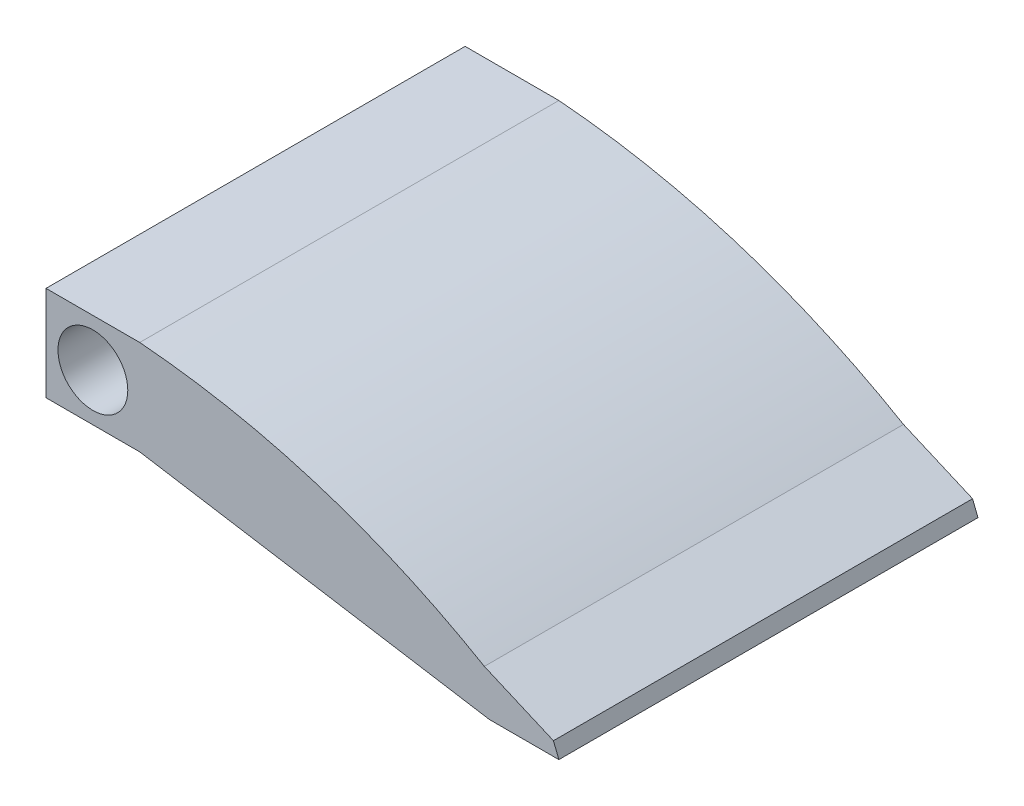
ISO-10303-21;
HEADER;
FILE_DESCRIPTION(('STEP AP214'),'2;1');
FILE_NAME('part.step','',(''),(''),'','','');
FILE_SCHEMA(('AUTOMOTIVE_DESIGN { 1 0 10303 214 1 1 1 1 }'));
ENDSEC;
DATA;
#1=APPLICATION_CONTEXT('core data for automotive mechanical design processes');
#2=APPLICATION_PROTOCOL_DEFINITION('international standard','automotive_design',2000,#1);
#3=PRODUCT_CONTEXT('',#1,'mechanical');
#4=PRODUCT('Part','Part','',(#3));
#5=PRODUCT_RELATED_PRODUCT_CATEGORY('part','',(#4));
#6=PRODUCT_DEFINITION_FORMATION('','',#4);
#7=PRODUCT_DEFINITION_CONTEXT('part definition',#1,'design');
#8=PRODUCT_DEFINITION('design','',#6,#7);
#9=PRODUCT_DEFINITION_SHAPE('','',#8);
#10=(LENGTH_UNIT() NAMED_UNIT(*) SI_UNIT(.MILLI.,.METRE.));
#11=(NAMED_UNIT(*) PLANE_ANGLE_UNIT() SI_UNIT($,.RADIAN.));
#12=(NAMED_UNIT(*) SI_UNIT($,.STERADIAN.) SOLID_ANGLE_UNIT());
#13=UNCERTAINTY_MEASURE_WITH_UNIT(LENGTH_MEASURE(1.E-05),#10,'distance_accuracy_value','');
#14=(GEOMETRIC_REPRESENTATION_CONTEXT(3) GLOBAL_UNCERTAINTY_ASSIGNED_CONTEXT((#13)) GLOBAL_UNIT_ASSIGNED_CONTEXT((#10,
#11,#12)) REPRESENTATION_CONTEXT('',''));
#15=CARTESIAN_POINT('',(0.,0.,0.));
#16=DIRECTION('',(0.,0.,1.));
#17=DIRECTION('',(1.,0.,0.));
#18=AXIS2_PLACEMENT_3D('',#15,#16,#17);
#19=CARTESIAN_POINT('',(-3.36977710472858,0.,30.13));
#20=DIRECTION('',(-1.,0.,0.));
#21=DIRECTION('',(0.,0.,1.));
#22=AXIS2_PLACEMENT_3D('',#19,#20,#21);
#23=PLANE('',#22);
#24=DIRECTION('',(0.,1.,0.));
#25=VECTOR('',#24,1.);
#26=CARTESIAN_POINT('',(-3.36977710472858,0.,0.));
#27=LINE('',#26,#25);
#28=CARTESIAN_POINT('',(-3.36977710472858,-3.40633888704991,0.));
#29=VERTEX_POINT('',#28);
#30=CARTESIAN_POINT('',(-3.36977710472858,3.40633888704991,0.));
#31=VERTEX_POINT('',#30);
#32=EDGE_CURVE('E150',#29,#31,#27,.T.);
#33=ORIENTED_EDGE('',*,*,#32,.F.);
#34=DIRECTION('',(0.,0.,-1.));
#35=VECTOR('',#34,1.);
#36=CARTESIAN_POINT('',(-3.36977710472858,-3.40633888704991,30.13));
#37=LINE('',#36,#35);
#38=CARTESIAN_POINT('',(-3.36977710472858,-3.40633888704991,30.13));
#39=VERTEX_POINT('',#38);
#40=EDGE_CURVE('E11',#39,#29,#37,.T.);
#41=ORIENTED_EDGE('',*,*,#40,.F.);
#42=DIRECTION('',(0.,1.,0.));
#43=VECTOR('',#42,1.);
#44=CARTESIAN_POINT('',(-3.36977710472858,0.,30.13));
#45=LINE('',#44,#43);
#46=CARTESIAN_POINT('',(-3.36977710472858,3.40633888704991,30.13));
#47=VERTEX_POINT('',#46);
#48=EDGE_CURVE('E213',#39,#47,#45,.T.);
#49=ORIENTED_EDGE('',*,*,#48,.T.);
#50=DIRECTION('',(0.,0.,-1.));
#51=VECTOR('',#50,1.);
#52=CARTESIAN_POINT('',(-3.36977710472858,3.40633888704991,30.13));
#53=LINE('',#52,#51);
#54=EDGE_CURVE('E86',#47,#31,#53,.T.);
#55=ORIENTED_EDGE('',*,*,#54,.T.);
#56=EDGE_LOOP('',(#33,#41,#49,#55));
#57=FACE_BOUND('',#56,.T.);
#58=ADVANCED_FACE('F35',(#57),#23,.T.);
#59=CARTESIAN_POINT('',(0.,-3.40633888704991,30.13));
#60=DIRECTION('',(0.,-1.,0.));
#61=DIRECTION('',(0.,0.,-1.));
#62=AXIS2_PLACEMENT_3D('',#59,#60,#61);
#63=PLANE('',#62);
#64=DIRECTION('',(-1.,0.,0.));
#65=VECTOR('',#64,1.);
#66=CARTESIAN_POINT('',(0.,-3.40633888704991,0.));
#67=LINE('',#66,#65);
#68=CARTESIAN_POINT('',(3.36977710472858,-3.40633888704991,0.));
#69=VERTEX_POINT('',#68);
#70=EDGE_CURVE('E148',#69,#29,#67,.T.);
#71=ORIENTED_EDGE('',*,*,#70,.F.);
#72=DIRECTION('',(0.,0.,-1.));
#73=VECTOR('',#72,1.);
#74=CARTESIAN_POINT('',(3.36977710472858,-3.40633888704991,30.13));
#75=LINE('',#74,#73);
#76=CARTESIAN_POINT('',(3.36977710472858,-3.40633888704991,30.13));
#77=VERTEX_POINT('',#76);
#78=EDGE_CURVE('E44',#77,#69,#75,.T.);
#79=ORIENTED_EDGE('',*,*,#78,.F.);
#80=DIRECTION('',(-1.,0.,0.));
#81=VECTOR('',#80,1.);
#82=CARTESIAN_POINT('',(0.,-3.40633888704991,30.13));
#83=LINE('',#82,#81);
#84=EDGE_CURVE('E215',#77,#39,#83,.T.);
#85=ORIENTED_EDGE('',*,*,#84,.T.);
#86=ORIENTED_EDGE('',*,*,#40,.T.);
#87=EDGE_LOOP('',(#71,#79,#85,#86));
#88=FACE_BOUND('',#87,.T.);
#89=ADVANCED_FACE('F149',(#88),#63,.T.);
#90=CARTESIAN_POINT('',(-0.453431097810579,-2.78355116353014,30.13));
#91=DIRECTION('',(-0.160777454076922,-0.986990683978599,0.));
#92=DIRECTION('',(0.986990683978599,-0.160777454076922,0.));
#93=AXIS2_PLACEMENT_3D('',#90,#91,#92);
#94=PLANE('',#93);
#95=DIRECTION('',(-0.986990683978599,0.160777454076922,0.));
#96=VECTOR('',#95,1.);
#97=CARTESIAN_POINT('',(-0.453431097810579,-2.78355116353014,0.));
#98=LINE('',#97,#96);
#99=CARTESIAN_POINT('',(28.5001998063725,-7.5,0.));
#100=VERTEX_POINT('',#99);
#101=EDGE_CURVE('E141',#100,#69,#98,.T.);
#102=ORIENTED_EDGE('',*,*,#101,.F.);
#103=DIRECTION('',(0.,0.,-1.));
#104=VECTOR('',#103,1.);
#105=CARTESIAN_POINT('',(28.5001998063725,-7.5,30.13));
#106=LINE('',#105,#104);
#107=CARTESIAN_POINT('',(28.5001998063725,-7.5,30.13));
#108=VERTEX_POINT('',#107);
#109=EDGE_CURVE('E134',#108,#100,#106,.T.);
#110=ORIENTED_EDGE('',*,*,#109,.F.);
#111=DIRECTION('',(-0.986990683978599,0.160777454076922,0.));
#112=VECTOR('',#111,1.);
#113=CARTESIAN_POINT('',(-0.453431097810579,-2.78355116353014,30.13));
#114=LINE('',#113,#112);
#115=EDGE_CURVE('E143',#108,#77,#114,.T.);
#116=ORIENTED_EDGE('',*,*,#115,.T.);
#117=ORIENTED_EDGE('',*,*,#78,.T.);
#118=EDGE_LOOP('',(#102,#110,#116,#117));
#119=FACE_BOUND('',#118,.T.);
#120=ADVANCED_FACE('F139',(#119),#94,.T.);
#121=CARTESIAN_POINT('',(0.,-7.5,30.13));
#122=DIRECTION('',(0.,1.,0.));
#123=DIRECTION('',(0.,0.,1.));
#124=AXIS2_PLACEMENT_3D('',#121,#122,#123);
#125=PLANE('',#124);
#126=DIRECTION('',(1.,0.,0.));
#127=VECTOR('',#126,1.);
#128=CARTESIAN_POINT('',(0.,-7.5,0.));
#129=LINE('',#128,#127);
#130=CARTESIAN_POINT('',(33.5001998063725,-7.5,0.));
#131=VERTEX_POINT('',#130);
#132=EDGE_CURVE('E155',#100,#131,#129,.T.);
#133=ORIENTED_EDGE('',*,*,#132,.T.);
#134=DIRECTION('',(0.,0.,-1.));
#135=VECTOR('',#134,1.);
#136=CARTESIAN_POINT('',(33.5001998063725,-7.5,30.13));
#137=LINE('',#136,#135);
#138=CARTESIAN_POINT('',(33.5001998063725,-7.5,30.13));
#139=VERTEX_POINT('',#138);
#140=EDGE_CURVE('E127',#139,#131,#137,.T.);
#141=ORIENTED_EDGE('',*,*,#140,.F.);
#142=DIRECTION('',(1.,0.,0.));
#143=VECTOR('',#142,1.);
#144=CARTESIAN_POINT('',(0.,-7.5,30.13));
#145=LINE('',#144,#143);
#146=EDGE_CURVE('E220',#108,#139,#145,.T.);
#147=ORIENTED_EDGE('',*,*,#146,.F.);
#148=ORIENTED_EDGE('',*,*,#109,.T.);
#149=EDGE_LOOP('',(#133,#141,#147,#148));
#150=FACE_BOUND('',#149,.T.);
#151=ADVANCED_FACE('F187',(#150),#125,.F.);
#152=CARTESIAN_POINT('',(26.3629938292167,10.4704295692362,30.13));
#153=DIRECTION('',(-0.929382813270599,-0.369117307095221,0.));
#154=DIRECTION('',(0.369117307095221,-0.929382813270599,0.));
#155=AXIS2_PLACEMENT_3D('',#152,#153,#154);
#156=PLANE('',#155);
#157=DIRECTION('',(-0.369117307095221,0.929382813270599,0.));
#158=VECTOR('',#157,1.);
#159=CARTESIAN_POINT('',(26.3629938292167,10.4704295692362,0.));
#160=LINE('',#159,#158);
#161=CARTESIAN_POINT('',(33.1096491532312,-6.51665118984113,0.));
#162=VERTEX_POINT('',#161);
#163=EDGE_CURVE('E157',#131,#162,#160,.T.);
#164=ORIENTED_EDGE('',*,*,#163,.T.);
#165=DIRECTION('',(0.,0.,-1.));
#166=VECTOR('',#165,1.);
#167=CARTESIAN_POINT('',(33.1096491532312,-6.51665118984113,30.13));
#168=LINE('',#167,#166);
#169=CARTESIAN_POINT('',(33.1096491532312,-6.51665118984113,30.13));
#170=VERTEX_POINT('',#169);
#171=EDGE_CURVE('E125',#170,#162,#168,.T.);
#172=ORIENTED_EDGE('',*,*,#171,.F.);
#173=DIRECTION('',(-0.369117307095221,0.929382813270599,0.));
#174=VECTOR('',#173,1.);
#175=CARTESIAN_POINT('',(26.3629938292167,10.4704295692362,30.13));
#176=LINE('',#175,#174);
#177=EDGE_CURVE('E118',#139,#170,#176,.T.);
#178=ORIENTED_EDGE('',*,*,#177,.F.);
#179=ORIENTED_EDGE('',*,*,#140,.T.);
#180=EDGE_LOOP('',(#164,#172,#178,#179));
#181=FACE_BOUND('',#180,.T.);
#182=ADVANCED_FACE('F190',(#181),#156,.F.);
#183=CARTESIAN_POINT('',(2.82606941245882,6.5498436576805,30.13));
#184=DIRECTION('',(-0.396167538681522,-0.91817824048222,0.));
#185=DIRECTION('',(0.91817824048222,-0.396167538681522,0.));
#186=AXIS2_PLACEMENT_3D('',#183,#184,#185);
#187=PLANE('',#186);
#188=DIRECTION('',(-0.91817824048222,0.396167538681522,0.));
#189=VECTOR('',#188,1.);
#190=CARTESIAN_POINT('',(2.82606941245882,6.5498436576805,0.));
#191=LINE('',#190,#189);
#192=CARTESIAN_POINT('',(28.143383307614,-4.37385011947054,0.));
#193=VERTEX_POINT('',#192);
#194=EDGE_CURVE('E124',#162,#193,#191,.T.);
#195=ORIENTED_EDGE('',*,*,#194,.T.);
#196=DIRECTION('',(0.,0.,-1.));
#197=VECTOR('',#196,1.);
#198=CARTESIAN_POINT('',(28.143383307614,-4.37385011947054,30.13));
#199=LINE('',#198,#197);
#200=CARTESIAN_POINT('',(28.143383307614,-4.37385011947054,30.13));
#201=VERTEX_POINT('',#200);
#202=EDGE_CURVE('E110',#201,#193,#199,.T.);
#203=ORIENTED_EDGE('',*,*,#202,.F.);
#204=DIRECTION('',(-0.91817824048222,0.396167538681522,0.));
#205=VECTOR('',#204,1.);
#206=CARTESIAN_POINT('',(2.82606941245882,6.5498436576805,30.13));
#207=LINE('',#206,#205);
#208=EDGE_CURVE('E113',#170,#201,#207,.T.);
#209=ORIENTED_EDGE('',*,*,#208,.F.);
#210=ORIENTED_EDGE('',*,*,#171,.T.);
#211=EDGE_LOOP('',(#195,#203,#209,#210));
#212=FACE_BOUND('',#211,.T.);
#213=ADVANCED_FACE('F123',(#212),#187,.F.);
#214=CARTESIAN_POINT('',(28.143383307614,-4.37385011947054,30.13));
#215=CARTESIAN_POINT('',(16.6661176531417,2.3165286314358,30.13));
#216=CARTESIAN_POINT('',(3.36977710472858,3.40633888704991,30.13));
#217=B_SPLINE_CURVE_WITH_KNOTS('',2,(#214,#215,#216),.UNSPECIFIED.,.F.,.F.,(3,3),(0.,1.),.UNSPECIFIED.);
#218=DIRECTION('',(0.,0.,-1.));
#219=VECTOR('',#218,1.);
#220=SURFACE_OF_LINEAR_EXTRUSION('',#217,#219);
#221=CARTESIAN_POINT('',(28.143383307614,-4.37385011947054,0.));
#222=CARTESIAN_POINT('',(16.6661176531417,2.3165286314358,0.));
#223=CARTESIAN_POINT('',(3.36977710472858,3.40633888704991,0.));
#224=B_SPLINE_CURVE_WITH_KNOTS('',2,(#221,#222,#223),.UNSPECIFIED.,.F.,.F.,(3,3),(0.,1.),.UNSPECIFIED.);
#225=CARTESIAN_POINT('',(3.36977710472858,3.40633888704991,0.));
#226=VERTEX_POINT('',#225);
#227=EDGE_CURVE('E164',#193,#226,#224,.T.);
#228=ORIENTED_EDGE('',*,*,#227,.T.);
#229=DIRECTION('',(0.,0.,-1.));
#230=VECTOR('',#229,1.);
#231=CARTESIAN_POINT('',(3.36977710472858,3.40633888704991,30.13));
#232=LINE('',#231,#230);
#233=CARTESIAN_POINT('',(3.36977710472858,3.40633888704991,30.13));
#234=VERTEX_POINT('',#233);
#235=EDGE_CURVE('E112',#234,#226,#232,.T.);
#236=ORIENTED_EDGE('',*,*,#235,.F.);
#237=EDGE_CURVE('E105',#201,#234,#217,.T.);
#238=ORIENTED_EDGE('',*,*,#237,.F.);
#239=ORIENTED_EDGE('',*,*,#202,.T.);
#240=EDGE_LOOP('',(#228,#236,#238,#239));
#241=FACE_BOUND('',#240,.T.);
#242=ADVANCED_FACE('F108',(#241),#220,.F.);
#243=CARTESIAN_POINT('',(0.,0.,30.13));
#244=DIRECTION('',(0.,0.,-1.));
#245=DIRECTION('',(-1.,0.,0.));
#246=AXIS2_PLACEMENT_3D('',#243,#244,#245);
#247=CYLINDRICAL_SURFACE('',#246,2.51);
#248=CARTESIAN_POINT('',(0.,0.,30.13));
#249=DIRECTION('',(0.,0.,1.));
#250=DIRECTION('',(1.,0.,0.));
#251=AXIS2_PLACEMENT_3D('',#248,#249,#250);
#252=CIRCLE('',#251,2.51);
#253=CARTESIAN_POINT('',(2.51,0.,30.13));
#254=VERTEX_POINT('',#253);
#255=EDGE_CURVE('E171',#254,#254,#252,.T.);
#256=ORIENTED_EDGE('',*,*,#255,.T.);
#257=EDGE_LOOP('',(#256));
#258=FACE_BOUND('',#257,.T.);
#259=CARTESIAN_POINT('',(0.,0.,0.));
#260=DIRECTION('',(0.,0.,1.));
#261=DIRECTION('',(1.,0.,0.));
#262=AXIS2_PLACEMENT_3D('',#259,#260,#261);
#263=CIRCLE('',#262,2.51);
#264=CARTESIAN_POINT('',(2.51,0.,0.));
#265=VERTEX_POINT('',#264);
#266=EDGE_CURVE('E177',#265,#265,#263,.T.);
#267=ORIENTED_EDGE('',*,*,#266,.F.);
#268=EDGE_LOOP('',(#267));
#269=FACE_BOUND('',#268,.T.);
#270=ADVANCED_FACE('F37',(#258,#269),#247,.F.);
#271=CARTESIAN_POINT('',(0.,3.40633888704991,30.13));
#272=DIRECTION('',(0.,-1.,0.));
#273=DIRECTION('',(0.,0.,-1.));
#274=AXIS2_PLACEMENT_3D('',#271,#272,#273);
#275=PLANE('',#274);
#276=DIRECTION('',(-1.,0.,0.));
#277=VECTOR('',#276,1.);
#278=CARTESIAN_POINT('',(0.,3.40633888704991,0.));
#279=LINE('',#278,#277);
#280=EDGE_CURVE('E79',#226,#31,#279,.T.);
#281=ORIENTED_EDGE('',*,*,#280,.T.);
#282=ORIENTED_EDGE('',*,*,#54,.F.);
#283=DIRECTION('',(-1.,0.,0.));
#284=VECTOR('',#283,1.);
#285=CARTESIAN_POINT('',(0.,3.40633888704991,30.13));
#286=LINE('',#285,#284);
#287=EDGE_CURVE('E52',#234,#47,#286,.T.);
#288=ORIENTED_EDGE('',*,*,#287,.F.);
#289=ORIENTED_EDGE('',*,*,#235,.T.);
#290=EDGE_LOOP('',(#281,#282,#288,#289));
#291=FACE_BOUND('',#290,.T.);
#292=ADVANCED_FACE('F199',(#291),#275,.F.);
#293=CARTESIAN_POINT('',(0.,0.,30.13));
#294=DIRECTION('',(0.,0.,1.));
#295=DIRECTION('',(1.,0.,0.));
#296=AXIS2_PLACEMENT_3D('',#293,#294,#295);
#297=PLANE('',#296);
#298=ORIENTED_EDGE('',*,*,#255,.F.);
#299=EDGE_LOOP('',(#298));
#300=FACE_BOUND('',#299,.T.);
#301=ORIENTED_EDGE('',*,*,#48,.F.);
#302=ORIENTED_EDGE('',*,*,#84,.F.);
#303=ORIENTED_EDGE('',*,*,#115,.F.);
#304=ORIENTED_EDGE('',*,*,#146,.T.);
#305=ORIENTED_EDGE('',*,*,#177,.T.);
#306=ORIENTED_EDGE('',*,*,#208,.T.);
#307=ORIENTED_EDGE('',*,*,#237,.T.);
#308=ORIENTED_EDGE('',*,*,#287,.T.);
#309=EDGE_LOOP('',(#301,#302,#303,#304,#305,#306,#307,#308));
#310=FACE_BOUND('',#309,.T.);
#311=ADVANCED_FACE('F116',(#300,#310),#297,.T.);
#312=CARTESIAN_POINT('',(0.,0.,0.));
#313=DIRECTION('',(0.,0.,1.));
#314=DIRECTION('',(1.,0.,0.));
#315=AXIS2_PLACEMENT_3D('',#312,#313,#314);
#316=PLANE('',#315);
#317=ORIENTED_EDGE('',*,*,#266,.T.);
#318=EDGE_LOOP('',(#317));
#319=FACE_BOUND('',#318,.T.);
#320=ORIENTED_EDGE('',*,*,#32,.T.);
#321=ORIENTED_EDGE('',*,*,#280,.F.);
#322=ORIENTED_EDGE('',*,*,#227,.F.);
#323=ORIENTED_EDGE('',*,*,#194,.F.);
#324=ORIENTED_EDGE('',*,*,#163,.F.);
#325=ORIENTED_EDGE('',*,*,#132,.F.);
#326=ORIENTED_EDGE('',*,*,#101,.T.);
#327=ORIENTED_EDGE('',*,*,#70,.T.);
#328=EDGE_LOOP('',(#320,#321,#322,#323,#324,#325,#326,#327));
#329=FACE_BOUND('',#328,.T.);
#330=ADVANCED_FACE('F153',(#319,#329),#316,.F.);
#331=CLOSED_SHELL('',(#58,#89,#120,#151,#182,#213,#242,#270,#292,#311,#330));
#332=MANIFOLD_SOLID_BREP('B2',#331);
#333=ADVANCED_BREP_SHAPE_REPRESENTATION('',(#18,#332),#14);
#334=SHAPE_DEFINITION_REPRESENTATION(#9,#333);
ENDSEC;
END-ISO-10303-21;
